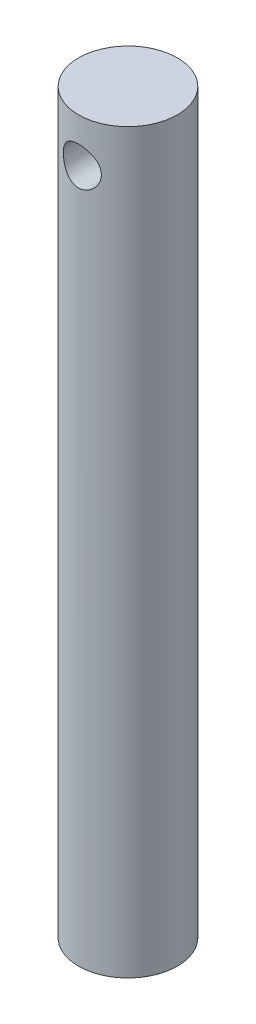
ISO-10303-21;
HEADER;
FILE_DESCRIPTION(('STEP AP214'),'2;1');
FILE_NAME('part.step','',(''),(''),'','','');
FILE_SCHEMA(('AUTOMOTIVE_DESIGN { 1 0 10303 214 1 1 1 1 }'));
ENDSEC;
DATA;
#1=APPLICATION_CONTEXT('core data for automotive mechanical design processes');
#2=APPLICATION_PROTOCOL_DEFINITION('international standard','automotive_design',2000,#1);
#3=PRODUCT_CONTEXT('',#1,'mechanical');
#4=PRODUCT('Part','Part','',(#3));
#5=PRODUCT_RELATED_PRODUCT_CATEGORY('part','',(#4));
#6=PRODUCT_DEFINITION_FORMATION('','',#4);
#7=PRODUCT_DEFINITION_CONTEXT('part definition',#1,'design');
#8=PRODUCT_DEFINITION('design','',#6,#7);
#9=PRODUCT_DEFINITION_SHAPE('','',#8);
#10=(LENGTH_UNIT() NAMED_UNIT(*) SI_UNIT(.MILLI.,.METRE.));
#11=(NAMED_UNIT(*) PLANE_ANGLE_UNIT() SI_UNIT($,.RADIAN.));
#12=(NAMED_UNIT(*) SI_UNIT($,.STERADIAN.) SOLID_ANGLE_UNIT());
#13=UNCERTAINTY_MEASURE_WITH_UNIT(LENGTH_MEASURE(1.E-05),#10,'distance_accuracy_value','');
#14=(GEOMETRIC_REPRESENTATION_CONTEXT(3) GLOBAL_UNCERTAINTY_ASSIGNED_CONTEXT((#13)) GLOBAL_UNIT_ASSIGNED_CONTEXT((#10,
#11,#12)) REPRESENTATION_CONTEXT('',''));
#15=CARTESIAN_POINT('',(0.,0.,0.));
#16=DIRECTION('',(0.,0.,1.));
#17=DIRECTION('',(1.,0.,0.));
#18=AXIS2_PLACEMENT_3D('',#15,#16,#17);
#19=CARTESIAN_POINT('',(0.,127.,0.));
#20=DIRECTION('',(0.,-1.,0.));
#21=DIRECTION('',(0.,0.,-1.));
#22=AXIS2_PLACEMENT_3D('',#19,#20,#21);
#23=CYLINDRICAL_SURFACE('',#22,9.906);
#24=CARTESIAN_POINT('',(-3.81,138.938,9.144));
#25=CARTESIAN_POINT('',(-3.81000064407979,138.835367761557,9.14399940626881));
#26=CARTESIAN_POINT('',(-3.80584949466351,138.732743870049,9.14573263028228));
#27=CARTESIAN_POINT('',(-3.78929119284377,138.528245611501,9.15260559865723));
#28=CARTESIAN_POINT('',(-3.77688145220304,138.426371489562,9.15774641095272));
#29=CARTESIAN_POINT('',(-3.74393962490596,138.22421007908,9.17126322748425));
#30=CARTESIAN_POINT('',(-3.72341135670093,138.123922067558,9.17963771075854));
#31=CARTESIAN_POINT('',(-3.67444672922316,137.925579710643,9.1993459318876));
#32=CARTESIAN_POINT('',(-3.64600722875716,137.827526269264,9.210680845086));
#33=CARTESIAN_POINT('',(-3.54937685298785,137.538293402116,9.24854539144749));
#34=CARTESIAN_POINT('',(-3.46975226991935,137.351305122067,9.27898805963824));
#35=CARTESIAN_POINT('',(-3.2825953359449,136.993377578225,9.34683127229454));
#36=CARTESIAN_POINT('',(-3.17505415950617,136.822443413082,9.38423401605287));
#37=CARTESIAN_POINT('',(-2.9290577708463,136.49238282444,9.46398061417543));
#38=CARTESIAN_POINT('',(-2.78937450425499,136.334206028794,9.50647493369805));
#39=CARTESIAN_POINT('',(-2.48566837123645,136.042855648947,9.59036424595744));
#40=CARTESIAN_POINT('',(-2.32163997465159,135.909687761297,9.63175898639211));
#41=CARTESIAN_POINT('',(-1.96661228086564,135.667475176788,9.71058508592759));
#42=CARTESIAN_POINT('',(-1.77485371515296,135.559473496429,9.74781970452447));
#43=CARTESIAN_POINT('',(-1.37420271446898,135.377661781081,9.81231290433514));
#44=CARTESIAN_POINT('',(-1.16531658852297,135.303839222045,9.83957513889883));
#45=CARTESIAN_POINT('',(-0.746345393346816,135.195844056231,9.87998335779282));
#46=CARTESIAN_POINT('',(-0.536740129616208,135.160031982889,9.89371103140016));
#47=CARTESIAN_POINT('',(-0.114075261824232,135.123811580983,9.90759658617764));
#48=CARTESIAN_POINT('',(0.0989831355955358,135.123391141241,9.90775910940382));
#49=CARTESIAN_POINT('',(0.510717937437508,135.157032339318,9.89485997669889));
#50=CARTESIAN_POINT('',(0.709566088010392,135.18930201241,9.88248555149261));
#51=CARTESIAN_POINT('',(1.09877395484567,135.284380357875,9.84681373399076));
#52=CARTESIAN_POINT('',(1.28913306588263,135.347191203893,9.82351556424673));
#53=CARTESIAN_POINT('',(1.65930924013136,135.502351858105,9.76786112314378));
#54=CARTESIAN_POINT('',(1.83892884044366,135.595124647285,9.735376027404));
#55=CARTESIAN_POINT('',(2.18050433069836,135.807193478922,9.66461111215741));
#56=CARTESIAN_POINT('',(2.34245434320434,135.926498306882,9.62632937456256));
#57=CARTESIAN_POINT('',(2.6546141636287,136.196775727086,9.54512711153657));
#58=CARTESIAN_POINT('',(2.80349766677959,136.349240202233,9.50206607612672));
#59=CARTESIAN_POINT('',(3.07409976914635,136.677198128024,9.41800771900413));
#60=CARTESIAN_POINT('',(3.19581079788691,136.85269797494,9.37701097487769));
#61=CARTESIAN_POINT('',(3.41133193648662,137.227239500013,9.30081059772249));
#62=CARTESIAN_POINT('',(3.50438873364169,137.426751143538,9.26577274018051));
#63=CARTESIAN_POINT('',(3.65507214474186,137.840318039828,9.20738248122136));
#64=CARTESIAN_POINT('',(3.71271971060063,138.054364608731,9.18402317104371));
#65=CARTESIAN_POINT('',(3.78785230231926,138.477767574732,9.15328218541058));
#66=CARTESIAN_POINT('',(3.80745520129422,138.68668648539,9.14505937476269));
#67=CARTESIAN_POINT('',(3.81207771836109,139.104944675398,9.14313523480919));
#68=CARTESIAN_POINT('',(3.79710664273498,139.314283826476,9.14942999780548));
#69=CARTESIAN_POINT('',(3.73492969483969,139.716245247047,9.1749740058038));
#70=CARTESIAN_POINT('',(3.68940556027745,139.909175747685,9.19354667342028));
#71=CARTESIAN_POINT('',(3.56955542769551,140.284557063414,9.24073740296942));
#72=CARTESIAN_POINT('',(3.49522334435248,140.467005654976,9.26935758719549));
#73=CARTESIAN_POINT('',(3.31663888856321,140.824106517288,9.33477870200858));
#74=CARTESIAN_POINT('',(3.21133968577424,140.998183599877,9.37185342294639));
#75=CARTESIAN_POINT('',(2.97490700981402,141.326945735599,9.4495624591012));
#76=CARTESIAN_POINT('',(2.8437636654063,141.481623341996,9.49019813112897));
#77=CARTESIAN_POINT('',(2.54893041522458,141.778003070045,9.57375445727994));
#78=CARTESIAN_POINT('',(2.38364407893408,141.918131286564,9.61664483286183));
#79=CARTESIAN_POINT('',(2.03085929944928,142.16887184677,9.69727511936323));
#80=CARTESIAN_POINT('',(1.84336049333767,142.279483708109,9.73501494610908));
#81=CARTESIAN_POINT('',(1.45131942169701,142.467432143206,9.80111641873104));
#82=CARTESIAN_POINT('',(1.24681828496458,142.54484637833,9.82949991606386));
#83=CARTESIAN_POINT('',(0.826347495284124,142.663710045121,9.87373148779787));
#84=CARTESIAN_POINT('',(0.610383605247227,142.705177370744,9.88958579873585));
#85=CARTESIAN_POINT('',(0.187306801994696,142.748966599566,9.90635333328099));
#86=CARTESIAN_POINT('',(-0.0195433025637882,142.753520351434,9.90811831216707));
#87=CARTESIAN_POINT('',(-0.430943143853496,142.729151849029,9.89875943186073));
#88=CARTESIAN_POINT('',(-0.635493179334599,142.700233994214,9.88763726653536));
#89=CARTESIAN_POINT('',(-1.03091524998151,142.611323247502,9.85415730172312));
#90=CARTESIAN_POINT('',(-1.22200670984564,142.552181193136,9.8321076106909));
#91=CARTESIAN_POINT('',(-1.59155178379963,142.40536444401,9.77909410209705));
#92=CARTESIAN_POINT('',(-1.77000299715905,142.31768434669,9.74812859680339));
#93=CARTESIAN_POINT('',(-2.11760943784215,142.112012506323,9.67870518515733));
#94=CARTESIAN_POINT('',(-2.28603587580459,141.992880309749,9.63998253613216));
#95=CARTESIAN_POINT('',(-2.60118581085774,141.72944025956,9.55976767633285));
#96=CARTESIAN_POINT('',(-2.74790137698855,141.585123247705,9.51827446146684));
#97=CARTESIAN_POINT('',(-3.02395872855298,141.265830579638,9.43432533411643));
#98=CARTESIAN_POINT('',(-3.15186128444348,141.08958796698,9.39194630964859));
#99=CARTESIAN_POINT('',(-3.37636605799997,140.716634384034,9.31360345072929));
#100=CARTESIAN_POINT('',(-3.47296180622188,140.519919194241,9.27764094291817));
#101=CARTESIAN_POINT('',(-3.59440689020919,140.206875300182,9.23098564767509));
#102=CARTESIAN_POINT('',(-3.63171131729941,140.095817834503,9.21632772326485));
#103=CARTESIAN_POINT('',(-3.69601474500478,139.870356985496,9.1907300197407));
#104=CARTESIAN_POINT('',(-3.72301848526011,139.755955167153,9.17978853084318));
#105=CARTESIAN_POINT('',(-3.7663630913293,139.524880622978,9.16208998800678));
#106=CARTESIAN_POINT('',(-3.78270805513767,139.408208787691,9.15533132594167));
#107=CARTESIAN_POINT('',(-3.80452532812323,139.173687514795,9.14628700667753));
#108=CARTESIAN_POINT('',(-3.8099992604932,139.055838255633,9.14400068169854));
#109=CARTESIAN_POINT('',(-3.81,138.938,9.144));
#110=B_SPLINE_CURVE_WITH_KNOTS('',3,(#24,#25,#26,#27,#28,#29,#30,#31,#32,#33,#34,#35,#36,#37,
#38,#39,#40,#41,#42,#43,#44,#45,#46,#47,#48,#49,#50,#51,#52,#53,#54,#55,#56,#57,#58,#59,#60,#61,
#62,#63,#64,#65,#66,#67,#68,#69,#70,#71,#72,#73,#74,#75,#76,#77,#78,#79,#80,#81,#82,#83,#84,#85,
#86,#87,#88,#89,#90,#91,#92,#93,#94,#95,#96,#97,#98,#99,#100,#101,#102,#103,#104,#105,#106,#107,
#108,#109),.UNSPECIFIED.,.T.,.F.,(4,2,2,2,2,2,2,2,2,2,2,2,2,2,2,2,2,2,2,2,2,2,2,2,2,2,2,2,2,2,2,
2,2,2,2,2,2,2,2,2,2,2,4),(0.,0.307783699913211,0.615663904497332,0.923399473237848,
1.23125740471694,1.84475689700249,2.4584505773025,3.1013622734596,3.74442023542112,
4.41066635064775,5.07666814378749,5.71260479854275,6.34832383199484,6.95098485615205,
7.55368877851336,8.16530319158036,8.77712042972128,9.42640472419681,10.0758696895043,
10.7411829127898,11.4061020849495,12.0328057673849,12.6593407795574,13.2539443428474,
13.8486735773152,14.4664247782322,15.084412389733,15.7439919439602,16.4035822761807,
17.0616210549078,17.719332081109,18.3369559627867,18.9544986741085,19.5555431735343,
20.1567015234402,20.7836878595226,21.4109026706713,22.0733564103163,22.735946956593,
23.0896837212891,23.4432575246973,23.7966953088245,24.1500803159167),.UNSPECIFIED.);
#111=CARTESIAN_POINT('',(-3.81,138.938,9.144));
#112=VERTEX_POINT('',#111);
#113=EDGE_CURVE('E48',#112,#112,#110,.T.);
#114=ORIENTED_EDGE('',*,*,#113,.F.);
#115=EDGE_LOOP('',(#114));
#116=FACE_BOUND('',#115,.T.);
#117=CARTESIAN_POINT('',(0.,0.,0.));
#118=DIRECTION('',(0.,1.,0.));
#119=DIRECTION('',(0.,0.,1.));
#120=AXIS2_PLACEMENT_3D('',#117,#118,#119);
#121=CIRCLE('',#120,9.906);
#122=CARTESIAN_POINT('',(0.,0.,9.906));
#123=VERTEX_POINT('',#122);
#124=EDGE_CURVE('E10',#123,#123,#121,.T.);
#125=ORIENTED_EDGE('',*,*,#124,.T.);
#126=EDGE_LOOP('',(#125));
#127=FACE_BOUND('',#126,.T.);
#128=CARTESIAN_POINT('',(0.,147.828,0.));
#129=DIRECTION('',(0.,1.,0.));
#130=DIRECTION('',(0.,0.,1.));
#131=AXIS2_PLACEMENT_3D('',#128,#129,#130);
#132=CIRCLE('',#131,9.906);
#133=CARTESIAN_POINT('',(0.,147.828,9.906));
#134=VERTEX_POINT('',#133);
#135=EDGE_CURVE('E42',#134,#134,#132,.T.);
#136=ORIENTED_EDGE('',*,*,#135,.F.);
#137=EDGE_LOOP('',(#136));
#138=FACE_BOUND('',#137,.T.);
#139=CARTESIAN_POINT('',(0.,142.748,-9.906));
#140=CARTESIAN_POINT('',(0.102951452316558,142.748000540181,-9.90600041909554));
#141=CARTESIAN_POINT('',(0.205894927827269,142.743823799372,-9.90439155058628));
#142=CARTESIAN_POINT('',(0.411041392529844,142.727160702098,-9.89800056696715));
#143=CARTESIAN_POINT('',(0.513244143076979,142.714671778305,-9.89321747145675));
#144=CARTESIAN_POINT('',(0.716065064591693,142.681514315182,-9.88060721885944));
#145=CARTESIAN_POINT('',(0.816684126193067,142.660850557545,-9.872781841336));
#146=CARTESIAN_POINT('',(1.0156970813858,142.611552563163,-9.85429911685564));
#147=CARTESIAN_POINT('',(1.11409009309105,142.582915225334,-9.84364066813414));
#148=CARTESIAN_POINT('',(1.40443710397768,142.485558200413,-9.80786432119326));
#149=CARTESIAN_POINT('',(1.59219093239979,142.405288729901,-9.77890360316625));
#150=CARTESIAN_POINT('',(1.95143768746361,142.216606040951,-9.71360881281954));
#151=CARTESIAN_POINT('',(2.12292600606045,142.108184879417,-9.6772726601279));
#152=CARTESIAN_POINT('',(2.45252198036719,141.861232768004,-9.59915498221588));
#153=CARTESIAN_POINT('',(2.6098211464377,141.72167178536,-9.55721388477039));
#154=CARTESIAN_POINT('',(2.89943346528226,141.418595841145,-9.47337879291962));
#155=CARTESIAN_POINT('',(3.03173838216358,141.255073015276,-9.43148481854643));
#156=CARTESIAN_POINT('',(3.27290116765288,140.900645483747,-9.35060484769927));
#157=CARTESIAN_POINT('',(3.38059243318892,140.708900036692,-9.31180533805852));
#158=CARTESIAN_POINT('',(3.56183491545811,140.308294409781,-9.24400363096624));
#159=CARTESIAN_POINT('',(3.63540057600028,140.099441514846,-9.2149972899315));
#160=CARTESIAN_POINT('',(3.74306987828454,139.679888184203,-9.1717784194632));
#161=CARTESIAN_POINT('',(3.77872447737679,139.469647473881,-9.15698705872038));
#162=CARTESIAN_POINT('',(3.81440741292258,139.045686660274,-9.14218483682008));
#163=CARTESIAN_POINT('',(3.81445146171521,138.831968133123,-9.14216745698198));
#164=CARTESIAN_POINT('',(3.78009387905088,138.421570871199,-9.15641812435042));
#165=CARTESIAN_POINT('',(3.747878645666,138.224671663566,-9.16977941769957));
#166=CARTESIAN_POINT('',(3.65354320626027,137.839325418683,-9.20776934597109));
#167=CARTESIAN_POINT('',(3.59141825413749,137.650879728035,-9.23239976905859));
#168=CARTESIAN_POINT('',(3.4378797979702,137.283456732933,-9.29067540177976));
#169=CARTESIAN_POINT('',(3.34591838520649,137.104735972045,-9.32448715543932));
#170=CARTESIAN_POINT('',(3.13570028088474,136.76464207314,-9.39726392320105));
#171=CARTESIAN_POINT('',(3.01743418717182,136.60327516863,-9.43623077788224));
#172=CARTESIAN_POINT('',(2.74808465365681,136.290417038269,-9.51829966058227));
#173=CARTESIAN_POINT('',(2.59526752140433,136.140440109316,-9.56149886792701));
#174=CARTESIAN_POINT('',(2.26616725905917,135.86777906001,-9.64479686721688));
#175=CARTESIAN_POINT('',(2.08988014641493,135.745099581139,-9.6848951311425));
#176=CARTESIAN_POINT('',(1.71481867990617,135.528728106521,-9.75834583860276));
#177=CARTESIAN_POINT('',(1.51571263911431,135.435565057828,-9.79157184226019));
#178=CARTESIAN_POINT('',(1.10305545161451,135.284566459715,-9.84658992988401));
#179=CARTESIAN_POINT('',(0.889511120082673,135.226714370317,-9.86838736642081));
#180=CARTESIAN_POINT('',(0.466764432040498,135.150948114994,-9.8971382924258));
#181=CARTESIAN_POINT('',(0.257978418134734,135.130996368467,-9.90484819201818));
#182=CARTESIAN_POINT('',(-0.160077997450235,135.125632560432,-9.90690992089128));
#183=CARTESIAN_POINT('',(-0.369348273419032,135.140212362511,-9.90126489689365));
#184=CARTESIAN_POINT('',(-0.773465648622239,135.201967468535,-9.87774889043116));
#185=CARTESIAN_POINT('',(-0.96855271663508,135.247786866392,-9.86038677719541));
#186=CARTESIAN_POINT('',(-1.34811685532844,135.368912747283,-9.81569987909822));
#187=CARTESIAN_POINT('',(-1.53259254644601,135.444223054476,-9.78837380221666));
#188=CARTESIAN_POINT('',(-1.89188998396082,135.624622245618,-9.72542372218223));
#189=CARTESIAN_POINT('',(-2.06625793143414,135.730534453119,-9.68957596903461));
#190=CARTESIAN_POINT('',(-2.39534274723316,135.968207303259,-9.61351869012882));
#191=CARTESIAN_POINT('',(-2.55005206901514,136.099977823282,-9.57330750025266));
#192=CARTESIAN_POINT('',(-2.84532120305099,136.395083700072,-9.4898867707156));
#193=CARTESIAN_POINT('',(-2.98444005430399,136.559855209505,-9.44664408288323));
#194=CARTESIAN_POINT('',(-3.23336382696211,136.91122539351,-9.36437021488224));
#195=CARTESIAN_POINT('',(-3.34316534557832,137.097826598188,-9.32533952390247));
#196=CARTESIAN_POINT('',(-3.53065332722863,137.48955389667,-9.25599417091881));
#197=CARTESIAN_POINT('',(-3.60813972083793,137.694786088629,-9.2257341515192));
#198=CARTESIAN_POINT('',(-3.72690943213324,138.116884961153,-9.17840662755323));
#199=CARTESIAN_POINT('',(-3.76821675358831,138.33374382623,-9.16133037683006));
#200=CARTESIAN_POINT('',(-3.81125287715294,138.757236233413,-9.14350474253482));
#201=CARTESIAN_POINT('',(-3.81545531414887,138.963577341633,-9.1417351027162));
#202=CARTESIAN_POINT('',(-3.79056009296788,139.373865644301,-9.1520855377943));
#203=CARTESIAN_POINT('',(-3.76146594749028,139.577813088981,-9.16420414751848));
#204=CARTESIAN_POINT('',(-3.67276573608082,139.970504073708,-9.20009681907282));
#205=CARTESIAN_POINT('',(-3.61422380168038,140.159528490105,-9.22346323919623));
#206=CARTESIAN_POINT('',(-3.46925113825939,140.52516921338,-9.27896164988509));
#207=CARTESIAN_POINT('',(-3.38281319316615,140.701782295311,-9.31109590816096));
#208=CARTESIAN_POINT('',(-3.17905149397248,141.048032871229,-9.38268122968774));
#209=CARTESIAN_POINT('',(-3.06030482757507,141.216770028255,-9.4224349679241));
#210=CARTESIAN_POINT('',(-2.79748655958821,141.532696920512,-9.50378029216077));
#211=CARTESIAN_POINT('',(-2.65340670062997,141.67987960129,-9.5453724740836));
#212=CARTESIAN_POINT('',(-2.33387964048641,141.957327453219,-9.62863052795752));
#213=CARTESIAN_POINT('',(-2.15709627964755,142.086112712463,-9.6701602580737));
#214=CARTESIAN_POINT('',(-1.87669766081551,142.255543316826,-9.72707642139736));
#215=CARTESIAN_POINT('',(-1.78062474766151,142.30808951834,-9.74516237578806));
#216=CARTESIAN_POINT('',(-1.58399814617687,142.404847866079,-9.77904456847397));
#217=CARTESIAN_POINT('',(-1.48344635427935,142.449063498904,-9.79484176404302));
#218=CARTESIAN_POINT('',(-1.27179056260768,142.53138036069,-9.82463988840783));
#219=CARTESIAN_POINT('',(-1.1604280314039,142.568885828463,-9.83845357857587));
#220=CARTESIAN_POINT('',(-0.934399923631145,142.633511365517,-9.86248649658498));
#221=CARTESIAN_POINT('',(-0.819735845453673,142.660636068602,-9.87270732805266));
#222=CARTESIAN_POINT('',(-0.588136616839306,142.704175261241,-9.88920652580209));
#223=CARTESIAN_POINT('',(-0.471201974748701,142.720592120294,-9.89548576429246));
#224=CARTESIAN_POINT('',(-0.236174611331922,142.742503395554,-9.90388196215616));
#225=CARTESIAN_POINT('',(-0.118082058776632,142.74799938043,-9.90599951931067));
#226=CARTESIAN_POINT('',(0.,142.748,-9.906));
#227=B_SPLINE_CURVE_WITH_KNOTS('',3,(#139,#140,#141,#142,#143,#144,#145,#146,#147,#148,#149,
#150,#151,#152,#153,#154,#155,#156,#157,#158,#159,#160,#161,#162,#163,#164,#165,#166,#167,#168,
#169,#170,#171,#172,#173,#174,#175,#176,#177,#178,#179,#180,#181,#182,#183,#184,#185,#186,#187,
#188,#189,#190,#191,#192,#193,#194,#195,#196,#197,#198,#199,#200,#201,#202,#203,#204,#205,#206,
#207,#208,#209,#210,#211,#212,#213,#214,#215,#216,#217,#218,#219,#220,#221,#222,#223,#224,#225,
#226),.UNSPECIFIED.,.T.,.F.,(4,2,2,2,2,2,2,2,2,2,2,2,2,2,2,2,2,2,2,2,2,2,2,2,2,2,2,2,2,2,2,2,2,
2,2,2,2,2,2,2,2,2,2,4),(0.,0.308743121646664,0.617581646956943,0.926239790295092,
1.23501814502226,1.85067362481603,2.46650300306477,3.10694013952496,3.74758794070077,
4.4141816867313,5.08049303608294,5.71835167222403,6.35592886770874,6.95303333309825,
7.55023257882259,8.15908621225651,8.76815782065826,9.42046744169143,10.0728878926298,
10.7364133708131,11.3996278085575,12.0260491849151,12.6523229769474,13.2530125542254,
13.8537800502115,14.4725169663047,15.0914906898383,15.7482624243636,16.4051103556242,
17.0659666667115,17.7263841858652,18.342412027798,18.9583748864514,19.5535259705033,
20.1488311303645,20.7764800339403,21.4043339005841,22.068669274544,22.4012827158096,
22.7337566373318,23.0881629096421,23.4424107957836,23.79658026513,24.1506988580864),.UNSPECIFIED.);
#228=CARTESIAN_POINT('',(0.,142.748,-9.906));
#229=VERTEX_POINT('',#228);
#230=EDGE_CURVE('E35',#229,#229,#227,.T.);
#231=ORIENTED_EDGE('',*,*,#230,.F.);
#232=EDGE_LOOP('',(#231));
#233=FACE_BOUND('',#232,.T.);
#234=ADVANCED_FACE('F31',(#116,#127,#138,#233),#23,.T.);
#235=CARTESIAN_POINT('',(0.,0.,0.));
#236=DIRECTION('',(0.,1.,0.));
#237=DIRECTION('',(0.,0.,1.));
#238=AXIS2_PLACEMENT_3D('',#235,#236,#237);
#239=PLANE('',#238);
#240=ORIENTED_EDGE('',*,*,#124,.F.);
#241=EDGE_LOOP('',(#240));
#242=FACE_BOUND('',#241,.T.);
#243=ADVANCED_FACE('F60',(#242),#239,.F.);
#244=CARTESIAN_POINT('',(0.,147.828,0.));
#245=DIRECTION('',(0.,1.,0.));
#246=DIRECTION('',(0.,0.,1.));
#247=AXIS2_PLACEMENT_3D('',#244,#245,#246);
#248=PLANE('',#247);
#249=ORIENTED_EDGE('',*,*,#135,.T.);
#250=EDGE_LOOP('',(#249));
#251=FACE_BOUND('',#250,.T.);
#252=ADVANCED_FACE('F56',(#251),#248,.T.);
#253=CARTESIAN_POINT('',(0.,138.938,15.748));
#254=DIRECTION('',(0.,0.,-1.));
#255=DIRECTION('',(-1.,0.,0.));
#256=AXIS2_PLACEMENT_3D('',#253,#254,#255);
#257=CYLINDRICAL_SURFACE('',#256,3.81);
#258=ORIENTED_EDGE('',*,*,#113,.T.);
#259=EDGE_LOOP('',(#258));
#260=FACE_BOUND('',#259,.T.);
#261=ORIENTED_EDGE('',*,*,#230,.T.);
#262=EDGE_LOOP('',(#261));
#263=FACE_BOUND('',#262,.T.);
#264=ADVANCED_FACE('F52',(#260,#263),#257,.F.);
#265=CLOSED_SHELL('',(#234,#243,#252,#264));
#266=MANIFOLD_SOLID_BREP('B2',#265);
#267=ADVANCED_BREP_SHAPE_REPRESENTATION('',(#18,#266),#14);
#268=SHAPE_DEFINITION_REPRESENTATION(#9,#267);
ENDSEC;
END-ISO-10303-21;
